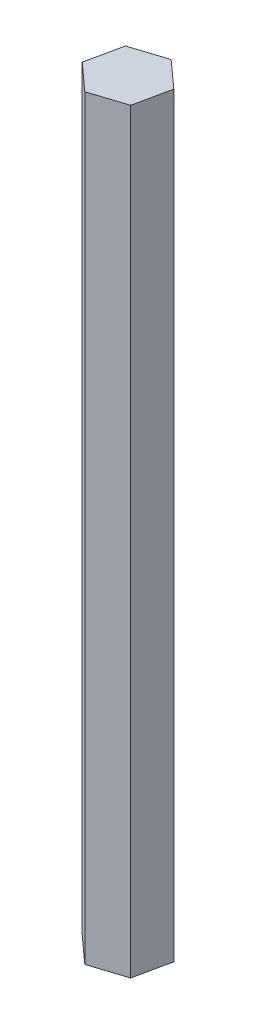
ISO-10303-21;
HEADER;
FILE_DESCRIPTION(('STEP AP214'),'2;1');
FILE_NAME('part.step','',(''),(''),'','','');
FILE_SCHEMA(('AUTOMOTIVE_DESIGN { 1 0 10303 214 1 1 1 1 }'));
ENDSEC;
DATA;
#1=APPLICATION_CONTEXT('core data for automotive mechanical design processes');
#2=APPLICATION_PROTOCOL_DEFINITION('international standard','automotive_design',2000,#1);
#3=PRODUCT_CONTEXT('',#1,'mechanical');
#4=PRODUCT('Part','Part','',(#3));
#5=PRODUCT_RELATED_PRODUCT_CATEGORY('part','',(#4));
#6=PRODUCT_DEFINITION_FORMATION('','',#4);
#7=PRODUCT_DEFINITION_CONTEXT('part definition',#1,'design');
#8=PRODUCT_DEFINITION('design','',#6,#7);
#9=PRODUCT_DEFINITION_SHAPE('','',#8);
#10=(LENGTH_UNIT() NAMED_UNIT(*) SI_UNIT(.MILLI.,.METRE.));
#11=(NAMED_UNIT(*) PLANE_ANGLE_UNIT() SI_UNIT($,.RADIAN.));
#12=(NAMED_UNIT(*) SI_UNIT($,.STERADIAN.) SOLID_ANGLE_UNIT());
#13=UNCERTAINTY_MEASURE_WITH_UNIT(LENGTH_MEASURE(1.E-05),#10,'distance_accuracy_value','');
#14=(GEOMETRIC_REPRESENTATION_CONTEXT(3) GLOBAL_UNCERTAINTY_ASSIGNED_CONTEXT((#13)) GLOBAL_UNIT_ASSIGNED_CONTEXT((#10,
#11,#12)) REPRESENTATION_CONTEXT('',''));
#15=CARTESIAN_POINT('',(0.,0.,0.));
#16=DIRECTION('',(0.,0.,1.));
#17=DIRECTION('',(1.,0.,0.));
#18=AXIS2_PLACEMENT_3D('',#15,#16,#17);
#19=CARTESIAN_POINT('',(-4.89451615472834,152.4,2.61727074902336));
#20=DIRECTION('',(-0.307073653476547,0.,-0.951685752410198));
#21=DIRECTION('',(-0.951685752410198,0.,0.307073653476547));
#22=AXIS2_PLACEMENT_3D('',#19,#20,#21);
#23=PLANE('',#22);
#24=DIRECTION('',(0.951685752410198,0.,-0.307073653476547));
#25=VECTOR('',#24,1.);
#26=CARTESIAN_POINT('',(-4.89451615472834,0.,2.61727074902336));
#27=LINE('',#26,#25);
#28=CARTESIAN_POINT('',(-4.89451615472834,0.,2.61727074902336));
#29=VERTEX_POINT('',#28);
#30=CARTESIAN_POINT('',(2.08357536706375,0.,0.365699731527632));
#31=VERTEX_POINT('',#30);
#32=EDGE_CURVE('E130',#29,#31,#27,.T.);
#33=ORIENTED_EDGE('',*,*,#32,.T.);
#34=DIRECTION('',(0.,-1.,0.));
#35=VECTOR('',#34,1.);
#36=CARTESIAN_POINT('',(2.08357536706375,152.4,0.365699731527632));
#37=LINE('',#36,#35);
#38=CARTESIAN_POINT('',(2.08357536706375,152.4,0.365699731527632));
#39=VERTEX_POINT('',#38);
#40=EDGE_CURVE('E11',#39,#31,#37,.T.);
#41=ORIENTED_EDGE('',*,*,#40,.F.);
#42=DIRECTION('',(0.951685752410198,0.,-0.307073653476547));
#43=VECTOR('',#42,1.);
#44=CARTESIAN_POINT('',(-4.89451615472834,152.4,2.61727074902336));
#45=LINE('',#44,#43);
#46=CARTESIAN_POINT('',(-4.89451615472834,152.4,2.61727074902336));
#47=VERTEX_POINT('',#46);
#48=EDGE_CURVE('E146',#47,#39,#45,.T.);
#49=ORIENTED_EDGE('',*,*,#48,.F.);
#50=DIRECTION('',(0.,-1.,0.));
#51=VECTOR('',#50,1.);
#52=CARTESIAN_POINT('',(-4.89451615472834,152.4,2.61727074902336));
#53=LINE('',#52,#51);
#54=EDGE_CURVE('E126',#47,#29,#53,.T.);
#55=ORIENTED_EDGE('',*,*,#54,.T.);
#56=EDGE_LOOP('',(#33,#41,#49,#55));
#57=FACE_BOUND('',#56,.T.);
#58=ADVANCED_FACE('F41',(#57),#23,.F.);
#59=CARTESIAN_POINT('',(2.08357536706375,152.4,0.365699731527632));
#60=DIRECTION('',(-0.977720864745213,0.,-0.20990929146151));
#61=DIRECTION('',(-0.20990929146151,0.,0.977720864745213));
#62=AXIS2_PLACEMENT_3D('',#59,#60,#61);
#63=PLANE('',#62);
#64=DIRECTION('',(0.20990929146151,0.,-0.977720864745213));
#65=VECTOR('',#64,1.);
#66=CARTESIAN_POINT('',(2.08357536706375,0.,0.365699731527632));
#67=LINE('',#66,#65);
#68=CARTESIAN_POINT('',(3.62270342838372,0.,-6.80329030502499));
#69=VERTEX_POINT('',#68);
#70=EDGE_CURVE('E134',#31,#69,#67,.T.);
#71=ORIENTED_EDGE('',*,*,#70,.T.);
#72=DIRECTION('',(0.,-1.,0.));
#73=VECTOR('',#72,1.);
#74=CARTESIAN_POINT('',(3.62270342838372,152.4,-6.80329030502499));
#75=LINE('',#74,#73);
#76=CARTESIAN_POINT('',(3.62270342838372,152.4,-6.80329030502499));
#77=VERTEX_POINT('',#76);
#78=EDGE_CURVE('E50',#77,#69,#75,.T.);
#79=ORIENTED_EDGE('',*,*,#78,.F.);
#80=DIRECTION('',(0.20990929146151,0.,-0.977720864745213));
#81=VECTOR('',#80,1.);
#82=CARTESIAN_POINT('',(2.08357536706375,152.4,0.365699731527632));
#83=LINE('',#82,#81);
#84=EDGE_CURVE('E95',#39,#77,#83,.T.);
#85=ORIENTED_EDGE('',*,*,#84,.F.);
#86=ORIENTED_EDGE('',*,*,#40,.T.);
#87=EDGE_LOOP('',(#71,#79,#85,#86));
#88=FACE_BOUND('',#87,.T.);
#89=ADVANCED_FACE('F174',(#88),#63,.F.);
#90=CARTESIAN_POINT('',(3.62270342838372,152.4,-6.80329030502499));
#91=DIRECTION('',(-0.670647211268666,0.,0.741776460948689));
#92=DIRECTION('',(0.741776460948689,0.,0.670647211268666));
#93=AXIS2_PLACEMENT_3D('',#90,#91,#92);
#94=PLANE('',#93);
#95=DIRECTION('',(-0.741776460948689,0.,-0.670647211268666));
#96=VECTOR('',#95,1.);
#97=CARTESIAN_POINT('',(3.62270342838372,0.,-6.80329030502499));
#98=LINE('',#97,#96);
#99=CARTESIAN_POINT('',(-1.8162600320884,0.,-11.7207093240819));
#100=VERTEX_POINT('',#99);
#101=EDGE_CURVE('E137',#69,#100,#98,.T.);
#102=ORIENTED_EDGE('',*,*,#101,.T.);
#103=DIRECTION('',(0.,-1.,0.));
#104=VECTOR('',#103,1.);
#105=CARTESIAN_POINT('',(-1.8162600320884,152.4,-11.7207093240819));
#106=LINE('',#105,#104);
#107=CARTESIAN_POINT('',(-1.8162600320884,152.4,-11.7207093240819));
#108=VERTEX_POINT('',#107);
#109=EDGE_CURVE('E119',#108,#100,#106,.T.);
#110=ORIENTED_EDGE('',*,*,#109,.F.);
#111=DIRECTION('',(-0.741776460948689,0.,-0.670647211268666));
#112=VECTOR('',#111,1.);
#113=CARTESIAN_POINT('',(3.62270342838372,152.4,-6.80329030502499));
#114=LINE('',#113,#112);
#115=EDGE_CURVE('E108',#77,#108,#114,.T.);
#116=ORIENTED_EDGE('',*,*,#115,.F.);
#117=ORIENTED_EDGE('',*,*,#78,.T.);
#118=EDGE_LOOP('',(#102,#110,#116,#117));
#119=FACE_BOUND('',#118,.T.);
#120=ADVANCED_FACE('F156',(#119),#94,.F.);
#121=CARTESIAN_POINT('',(-1.8162600320884,152.4,-11.7207093240819));
#122=DIRECTION('',(0.307073653476547,0.,0.951685752410198));
#123=DIRECTION('',(0.951685752410199,0.,-0.307073653476547));
#124=AXIS2_PLACEMENT_3D('',#121,#122,#123);
#125=PLANE('',#124);
#126=DIRECTION('',(-0.951685752410198,0.,0.307073653476547));
#127=VECTOR('',#126,1.);
#128=CARTESIAN_POINT('',(-1.8162600320884,0.,-11.7207093240819));
#129=LINE('',#128,#127);
#130=CARTESIAN_POINT('',(-8.79435155388049,0.,-9.46913830658617));
#131=VERTEX_POINT('',#130);
#132=EDGE_CURVE('E117',#100,#131,#129,.T.);
#133=ORIENTED_EDGE('',*,*,#132,.T.);
#134=DIRECTION('',(0.,-1.,0.));
#135=VECTOR('',#134,1.);
#136=CARTESIAN_POINT('',(-8.79435155388049,152.4,-9.46913830658617));
#137=LINE('',#136,#135);
#138=CARTESIAN_POINT('',(-8.79435155388049,152.4,-9.46913830658617));
#139=VERTEX_POINT('',#138);
#140=EDGE_CURVE('E114',#139,#131,#137,.T.);
#141=ORIENTED_EDGE('',*,*,#140,.F.);
#142=DIRECTION('',(-0.951685752410198,0.,0.307073653476547));
#143=VECTOR('',#142,1.);
#144=CARTESIAN_POINT('',(-1.8162600320884,152.4,-11.7207093240819));
#145=LINE('',#144,#143);
#146=EDGE_CURVE('E102',#108,#139,#145,.T.);
#147=ORIENTED_EDGE('',*,*,#146,.F.);
#148=ORIENTED_EDGE('',*,*,#109,.T.);
#149=EDGE_LOOP('',(#133,#141,#147,#148));
#150=FACE_BOUND('',#149,.T.);
#151=ADVANCED_FACE('F115',(#150),#125,.F.);
#152=CARTESIAN_POINT('',(-8.79435155388049,152.4,-9.46913830658617));
#153=DIRECTION('',(0.977720864745213,0.,0.20990929146151));
#154=DIRECTION('',(0.20990929146151,0.,-0.977720864745213));
#155=AXIS2_PLACEMENT_3D('',#152,#153,#154);
#156=PLANE('',#155);
#157=DIRECTION('',(-0.20990929146151,0.,0.977720864745213));
#158=VECTOR('',#157,1.);
#159=CARTESIAN_POINT('',(-8.79435155388049,0.,-9.46913830658617));
#160=LINE('',#159,#158);
#161=CARTESIAN_POINT('',(-10.3334796152005,0.,-2.30014827003354));
#162=VERTEX_POINT('',#161);
#163=EDGE_CURVE('E81',#131,#162,#160,.T.);
#164=ORIENTED_EDGE('',*,*,#163,.T.);
#165=DIRECTION('',(0.,-1.,0.));
#166=VECTOR('',#165,1.);
#167=CARTESIAN_POINT('',(-10.3334796152005,152.4,-2.30014827003354));
#168=LINE('',#167,#166);
#169=CARTESIAN_POINT('',(-10.3334796152005,152.4,-2.30014827003354));
#170=VERTEX_POINT('',#169);
#171=EDGE_CURVE('E120',#170,#162,#168,.T.);
#172=ORIENTED_EDGE('',*,*,#171,.F.);
#173=DIRECTION('',(-0.20990929146151,0.,0.977720864745213));
#174=VECTOR('',#173,1.);
#175=CARTESIAN_POINT('',(-8.79435155388049,152.4,-9.46913830658617));
#176=LINE('',#175,#174);
#177=EDGE_CURVE('E106',#139,#170,#176,.T.);
#178=ORIENTED_EDGE('',*,*,#177,.F.);
#179=ORIENTED_EDGE('',*,*,#140,.T.);
#180=EDGE_LOOP('',(#164,#172,#178,#179));
#181=FACE_BOUND('',#180,.T.);
#182=ADVANCED_FACE('F122',(#181),#156,.F.);
#183=CARTESIAN_POINT('',(-10.3334796152005,152.4,-2.30014827003354));
#184=DIRECTION('',(0.670647211268666,0.,-0.741776460948688));
#185=DIRECTION('',(-0.741776460948688,0.,-0.670647211268666));
#186=AXIS2_PLACEMENT_3D('',#183,#184,#185);
#187=PLANE('',#186);
#188=DIRECTION('',(0.741776460948688,0.,0.670647211268666));
#189=VECTOR('',#188,1.);
#190=CARTESIAN_POINT('',(-10.3334796152005,0.,-2.30014827003354));
#191=LINE('',#190,#189);
#192=EDGE_CURVE('E87',#162,#29,#191,.T.);
#193=ORIENTED_EDGE('',*,*,#192,.T.);
#194=ORIENTED_EDGE('',*,*,#54,.F.);
#195=DIRECTION('',(0.741776460948688,0.,0.670647211268666));
#196=VECTOR('',#195,1.);
#197=CARTESIAN_POINT('',(-10.3334796152005,152.4,-2.30014827003354));
#198=LINE('',#197,#196);
#199=EDGE_CURVE('E58',#170,#47,#198,.T.);
#200=ORIENTED_EDGE('',*,*,#199,.F.);
#201=ORIENTED_EDGE('',*,*,#171,.T.);
#202=EDGE_LOOP('',(#193,#194,#200,#201));
#203=FACE_BOUND('',#202,.T.);
#204=ADVANCED_FACE('F163',(#203),#187,.F.);
#205=CARTESIAN_POINT('',(0.,152.4,0.));
#206=DIRECTION('',(0.,1.,0.));
#207=DIRECTION('',(0.,0.,1.));
#208=AXIS2_PLACEMENT_3D('',#205,#206,#207);
#209=PLANE('',#208);
#210=ORIENTED_EDGE('',*,*,#48,.T.);
#211=ORIENTED_EDGE('',*,*,#84,.T.);
#212=ORIENTED_EDGE('',*,*,#115,.T.);
#213=ORIENTED_EDGE('',*,*,#146,.T.);
#214=ORIENTED_EDGE('',*,*,#177,.T.);
#215=ORIENTED_EDGE('',*,*,#199,.T.);
#216=EDGE_LOOP('',(#210,#211,#212,#213,#214,#215));
#217=FACE_BOUND('',#216,.T.);
#218=ADVANCED_FACE('F104',(#217),#209,.T.);
#219=CARTESIAN_POINT('',(0.,0.,0.));
#220=DIRECTION('',(0.,1.,0.));
#221=DIRECTION('',(0.,0.,1.));
#222=AXIS2_PLACEMENT_3D('',#219,#220,#221);
#223=PLANE('',#222);
#224=ORIENTED_EDGE('',*,*,#32,.F.);
#225=ORIENTED_EDGE('',*,*,#192,.F.);
#226=ORIENTED_EDGE('',*,*,#163,.F.);
#227=ORIENTED_EDGE('',*,*,#132,.F.);
#228=ORIENTED_EDGE('',*,*,#101,.F.);
#229=ORIENTED_EDGE('',*,*,#70,.F.);
#230=EDGE_LOOP('',(#224,#225,#226,#227,#228,#229));
#231=FACE_BOUND('',#230,.T.);
#232=ADVANCED_FACE('F159',(#231),#223,.F.);
#233=CLOSED_SHELL('',(#58,#89,#120,#151,#182,#204,#218,#232));
#234=MANIFOLD_SOLID_BREP('B2',#233);
#235=ADVANCED_BREP_SHAPE_REPRESENTATION('',(#18,#234),#14);
#236=SHAPE_DEFINITION_REPRESENTATION(#9,#235);
ENDSEC;
END-ISO-10303-21;
